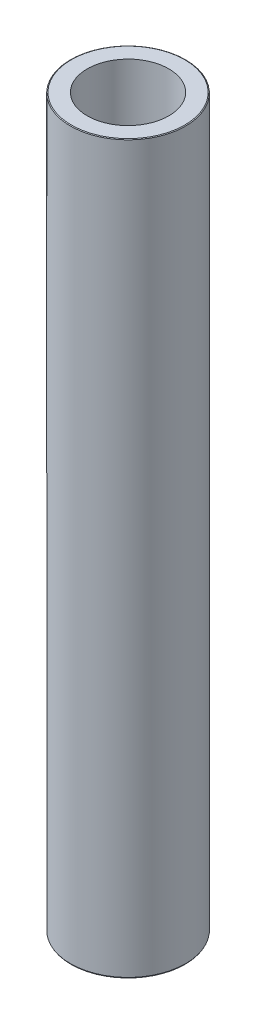
ISO-10303-21;
HEADER;
FILE_DESCRIPTION(('STEP AP214'),'2;1');
FILE_NAME('part.step','',(''),(''),'','','');
FILE_SCHEMA(('AUTOMOTIVE_DESIGN { 1 0 10303 214 1 1 1 1 }'));
ENDSEC;
DATA;
#1=APPLICATION_CONTEXT('core data for automotive mechanical design processes');
#2=APPLICATION_PROTOCOL_DEFINITION('international standard','automotive_design',2000,#1);
#3=PRODUCT_CONTEXT('',#1,'mechanical');
#4=PRODUCT('Part','Part','',(#3));
#5=PRODUCT_RELATED_PRODUCT_CATEGORY('part','',(#4));
#6=PRODUCT_DEFINITION_FORMATION('','',#4);
#7=PRODUCT_DEFINITION_CONTEXT('part definition',#1,'design');
#8=PRODUCT_DEFINITION('design','',#6,#7);
#9=PRODUCT_DEFINITION_SHAPE('','',#8);
#10=(LENGTH_UNIT() NAMED_UNIT(*) SI_UNIT(.MILLI.,.METRE.));
#11=(NAMED_UNIT(*) PLANE_ANGLE_UNIT() SI_UNIT($,.RADIAN.));
#12=(NAMED_UNIT(*) SI_UNIT($,.STERADIAN.) SOLID_ANGLE_UNIT());
#13=UNCERTAINTY_MEASURE_WITH_UNIT(LENGTH_MEASURE(1.E-05),#10,'distance_accuracy_value','');
#14=(GEOMETRIC_REPRESENTATION_CONTEXT(3) GLOBAL_UNCERTAINTY_ASSIGNED_CONTEXT((#13)) GLOBAL_UNIT_ASSIGNED_CONTEXT((#10,
#11,#12)) REPRESENTATION_CONTEXT('',''));
#15=CARTESIAN_POINT('',(0.,0.,0.));
#16=DIRECTION('',(0.,0.,1.));
#17=DIRECTION('',(1.,0.,0.));
#18=AXIS2_PLACEMENT_3D('',#15,#16,#17);
#19=CARTESIAN_POINT('',(0.,600.,0.));
#20=DIRECTION('',(0.,-1.,0.));
#21=DIRECTION('',(0.,0.,-1.));
#22=AXIS2_PLACEMENT_3D('',#19,#20,#21);
#23=CYLINDRICAL_SURFACE('',#22,47.5);
#24=CARTESIAN_POINT('',(0.,599.590765159549,0.));
#25=DIRECTION('',(0.,1.,0.));
#26=DIRECTION('',(0.,0.,1.));
#27=AXIS2_PLACEMENT_3D('',#24,#25,#26);
#28=CIRCLE('',#27,47.5);
#29=CARTESIAN_POINT('',(0.,599.590765159549,-47.5000000000001));
#30=VERTEX_POINT('',#29);
#31=EDGE_CURVE('E50',#30,#30,#28,.F.);
#32=ORIENTED_EDGE('',*,*,#31,.T.);
#33=EDGE_LOOP('',(#32));
#34=FACE_BOUND('',#33,.T.);
#35=CARTESIAN_POINT('',(0.,0.708815535888863,0.));
#36=DIRECTION('',(0.,1.,0.));
#37=DIRECTION('',(0.,0.,1.));
#38=AXIS2_PLACEMENT_3D('',#35,#36,#37);
#39=CIRCLE('',#38,47.5);
#40=CARTESIAN_POINT('',(0.,0.708815535888863,47.5));
#41=VERTEX_POINT('',#40);
#42=EDGE_CURVE('E51',#41,#41,#39,.T.);
#43=ORIENTED_EDGE('',*,*,#42,.T.);
#44=EDGE_LOOP('',(#43));
#45=FACE_BOUND('',#44,.T.);
#46=ADVANCED_FACE('F39',(#34,#45),#23,.T.);
#47=CARTESIAN_POINT('',(0.,600.,0.));
#48=DIRECTION('',(0.,1.,0.));
#49=DIRECTION('',(0.,0.,1.));
#50=AXIS2_PLACEMENT_3D('',#47,#48,#49);
#51=PLANE('',#50);
#52=CARTESIAN_POINT('',(0.,600.,0.));
#53=DIRECTION('',(0.,1.,0.));
#54=DIRECTION('',(0.,0.,1.));
#55=AXIS2_PLACEMENT_3D('',#52,#53,#54);
#56=CIRCLE('',#55,46.7911844641111);
#57=CARTESIAN_POINT('',(0.,600.,-46.7911844641112));
#58=VERTEX_POINT('',#57);
#59=EDGE_CURVE('E54',#58,#58,#56,.T.);
#60=ORIENTED_EDGE('',*,*,#59,.T.);
#61=EDGE_LOOP('',(#60));
#62=FACE_BOUND('',#61,.T.);
#63=CARTESIAN_POINT('',(0.,600.,0.));
#64=DIRECTION('',(0.,1.,0.));
#65=DIRECTION('',(0.,0.,1.));
#66=AXIS2_PLACEMENT_3D('',#63,#64,#65);
#67=CIRCLE('',#66,33.6700277402223);
#68=CARTESIAN_POINT('',(0.,600.,33.6700277402223));
#69=VERTEX_POINT('',#68);
#70=EDGE_CURVE('E58',#69,#69,#67,.T.);
#71=ORIENTED_EDGE('',*,*,#70,.F.);
#72=EDGE_LOOP('',(#71));
#73=FACE_BOUND('',#72,.T.);
#74=ADVANCED_FACE('F69',(#62,#73),#51,.T.);
#75=CARTESIAN_POINT('',(0.,0.,0.));
#76=DIRECTION('',(0.,1.,0.));
#77=DIRECTION('',(0.,0.,1.));
#78=AXIS2_PLACEMENT_3D('',#75,#76,#77);
#79=PLANE('',#78);
#80=CARTESIAN_POINT('',(0.,0.,0.));
#81=DIRECTION('',(0.,1.,0.));
#82=DIRECTION('',(0.,0.,1.));
#83=AXIS2_PLACEMENT_3D('',#80,#81,#82);
#84=CIRCLE('',#83,47.0907651595487);
#85=CARTESIAN_POINT('',(0.,0.,47.0907651595487));
#86=VERTEX_POINT('',#85);
#87=EDGE_CURVE('E10',#86,#86,#84,.F.);
#88=ORIENTED_EDGE('',*,*,#87,.T.);
#89=EDGE_LOOP('',(#88));
#90=FACE_BOUND('',#89,.T.);
#91=CARTESIAN_POINT('',(0.,0.,0.));
#92=DIRECTION('',(0.,1.,0.));
#93=DIRECTION('',(0.,0.,1.));
#94=AXIS2_PLACEMENT_3D('',#91,#92,#93);
#95=CIRCLE('',#94,33.6700277402223);
#96=CARTESIAN_POINT('',(0.,0.,33.6700277402223));
#97=VERTEX_POINT('',#96);
#98=EDGE_CURVE('E63',#97,#97,#95,.T.);
#99=ORIENTED_EDGE('',*,*,#98,.T.);
#100=EDGE_LOOP('',(#99));
#101=FACE_BOUND('',#100,.T.);
#102=ADVANCED_FACE('F75',(#90,#101),#79,.F.);
#103=CARTESIAN_POINT('',(0.,600.,0.));
#104=DIRECTION('',(0.,-1.,0.));
#105=DIRECTION('',(0.,0.,-1.));
#106=AXIS2_PLACEMENT_3D('',#103,#104,#105);
#107=CYLINDRICAL_SURFACE('',#106,33.6700277402223);
#108=ORIENTED_EDGE('',*,*,#70,.T.);
#109=EDGE_LOOP('',(#108));
#110=FACE_BOUND('',#109,.T.);
#111=ORIENTED_EDGE('',*,*,#98,.F.);
#112=EDGE_LOOP('',(#111));
#113=FACE_BOUND('',#112,.T.);
#114=ADVANCED_FACE('F70',(#110,#113),#107,.F.);
#115=CARTESIAN_POINT('',(0.,600.,0.));
#116=DIRECTION('',(0.,-1.,0.));
#117=DIRECTION('',(0.,0.,-1.));
#118=AXIS2_PLACEMENT_3D('',#115,#116,#117);
#119=CONICAL_SURFACE('',#118,46.7911844641111,1.04719755119665);
#120=CARTESIAN_POINT('',(0.,599.590765159549,-47.5000000000001));
#121=CARTESIAN_POINT('',(0.,599.59502802247,-47.4926165048346));
#122=CARTESIAN_POINT('',(0.,599.599290885391,-47.4852330096691));
#123=CARTESIAN_POINT('',(0.,599.607816611234,-47.4704660193381));
#124=CARTESIAN_POINT('',(0.,599.612079474156,-47.4630825241726));
#125=CARTESIAN_POINT('',(0.,599.620605199998,-47.4483155338415));
#126=CARTESIAN_POINT('',(0.,599.62486806292,-47.440932038676));
#127=CARTESIAN_POINT('',(0.,599.633393788762,-47.426165048345));
#128=CARTESIAN_POINT('',(0.,599.637656651684,-47.4187815531795));
#129=CARTESIAN_POINT('',(0.,599.646182377526,-47.4040145628485));
#130=CARTESIAN_POINT('',(0.,599.650445240448,-47.396631067683));
#131=CARTESIAN_POINT('',(0.,599.658970966291,-47.381864077352));
#132=CARTESIAN_POINT('',(0.,599.663233829212,-47.3744805821865));
#133=CARTESIAN_POINT('',(0.,599.671759555055,-47.3597135918554));
#134=CARTESIAN_POINT('',(0.,599.676022417976,-47.3523300966899));
#135=CARTESIAN_POINT('',(0.,599.684548143819,-47.3375631063589));
#136=CARTESIAN_POINT('',(0.,599.68881100674,-47.3301796111934));
#137=CARTESIAN_POINT('',(0.,599.697336732583,-47.3154126208624));
#138=CARTESIAN_POINT('',(0.,599.701599595504,-47.3080291256969));
#139=CARTESIAN_POINT('',(0.,599.710125321347,-47.2932621353658));
#140=CARTESIAN_POINT('',(0.,599.714388184268,-47.2858786402003));
#141=CARTESIAN_POINT('',(0.,599.722913910111,-47.2711116498693));
#142=CARTESIAN_POINT('',(0.,599.727176773032,-47.2637281547038));
#143=CARTESIAN_POINT('',(0.,599.735702498875,-47.2489611643728));
#144=CARTESIAN_POINT('',(0.,599.739965361797,-47.2415776692073));
#145=CARTESIAN_POINT('',(0.,599.748491087639,-47.2268106788763));
#146=CARTESIAN_POINT('',(0.,599.752753950561,-47.2194271837107));
#147=CARTESIAN_POINT('',(0.,599.761279676403,-47.2046601933797));
#148=CARTESIAN_POINT('',(0.,599.765542539325,-47.1972766982142));
#149=CARTESIAN_POINT('',(0.,599.774068265167,-47.1825097078832));
#150=CARTESIAN_POINT('',(0.,599.778331128089,-47.1751262127177));
#151=CARTESIAN_POINT('',(0.,599.786856853932,-47.1603592223867));
#152=CARTESIAN_POINT('',(0.,599.791119716853,-47.1529757272212));
#153=CARTESIAN_POINT('',(0.,599.799645442696,-47.1382087368902));
#154=CARTESIAN_POINT('',(0.,599.803908305617,-47.1308252417247));
#155=CARTESIAN_POINT('',(0.,599.81243403146,-47.1160582513936));
#156=CARTESIAN_POINT('',(0.,599.816696894381,-47.1086747562281));
#157=CARTESIAN_POINT('',(0.,599.825222620224,-47.0939077658971));
#158=CARTESIAN_POINT('',(0.,599.829485483145,-47.0865242707316));
#159=CARTESIAN_POINT('',(0.,599.838011208988,-47.0717572804006));
#160=CARTESIAN_POINT('',(0.,599.842274071909,-47.0643737852351));
#161=CARTESIAN_POINT('',(0.,599.850799797752,-47.049606794904));
#162=CARTESIAN_POINT('',(0.,599.855062660673,-47.0422232997385));
#163=CARTESIAN_POINT('',(0.,599.863588386516,-47.0274563094075));
#164=CARTESIAN_POINT('',(0.,599.867851249438,-47.020072814242));
#165=CARTESIAN_POINT('',(0.,599.87637697528,-47.005305823911));
#166=CARTESIAN_POINT('',(0.,599.880639838202,-46.9979223287455));
#167=CARTESIAN_POINT('',(0.,599.889165564044,-46.9831553384145));
#168=CARTESIAN_POINT('',(0.,599.893428426966,-46.9757718432489));
#169=CARTESIAN_POINT('',(0.,599.901954152808,-46.9610048529179));
#170=CARTESIAN_POINT('',(0.,599.90621701573,-46.9536213577524));
#171=CARTESIAN_POINT('',(0.,599.914742741573,-46.9388543674214));
#172=CARTESIAN_POINT('',(0.,599.919005604494,-46.9314708722559));
#173=CARTESIAN_POINT('',(0.,599.927531330337,-46.9167038819249));
#174=CARTESIAN_POINT('',(0.,599.931794193258,-46.9093203867594));
#175=CARTESIAN_POINT('',(0.,599.940319919101,-46.8945533964284));
#176=CARTESIAN_POINT('',(0.,599.944582782022,-46.8871699012628));
#177=CARTESIAN_POINT('',(0.,599.953108507865,-46.8724029109318));
#178=CARTESIAN_POINT('',(0.,599.957371370786,-46.8650194157663));
#179=CARTESIAN_POINT('',(0.,599.965897096629,-46.8502524254353));
#180=CARTESIAN_POINT('',(0.,599.97015995955,-46.8428689302698));
#181=CARTESIAN_POINT('',(0.,599.978685685393,-46.8281019399388));
#182=CARTESIAN_POINT('',(0.,599.982948548314,-46.8207184447732));
#183=CARTESIAN_POINT('',(0.,599.991474274157,-46.8059514544422));
#184=CARTESIAN_POINT('',(0.,599.995737137079,-46.7985679592767));
#185=CARTESIAN_POINT('',(0.,600.,-46.7911844641112));
#186=B_SPLINE_CURVE_WITH_KNOTS('',3,(#120,#121,#122,#123,#124,#125,#126,#127,#128,#129,#130,
#131,#132,#133,#134,#135,#136,#137,#138,#139,#140,#141,#142,#143,#144,#145,#146,#147,#148,#149,
#150,#151,#152,#153,#154,#155,#156,#157,#158,#159,#160,#161,#162,#163,#164,#165,#166,#167,#168,
#169,#170,#171,#172,#173,#174,#175,#176,#177,#178,#179,#180,#181,#182,#183,#184,#185),
.UNSPECIFIED.,.F.,.F.,(4,2,2,2,2,2,2,2,2,2,2,2,2,2,2,2,2,2,2,2,2,2,2,2,2,2,2,2,2,2,2,2,4),(0.,
0.0255771775281935,0.0511543550563811,0.0767315325845746,0.102308710112768,0.127885887640956,
0.153463065169205,0.179040242697392,0.204617420225586,0.230194597753779,0.255771775281967,
0.281348952810216,0.306926130338403,0.332503307866597,0.358080485394784,0.383657662922978,
0.409234840451227,0.434812017979414,0.460389195507608,0.485966373035795,0.511543550563989,
0.537120728092183,0.562697905620426,0.588275083148619,0.613852260676807,0.639429438205,
0.665006615733194,0.690583793261437,0.71616097078963,0.741738148317818,0.767315325846012,
0.792892503374205,0.818469680902448),.UNSPECIFIED.);
#187=EDGE_CURVE('BSEAM81',#30,#58,#186,.T.);
#188=ORIENTED_EDGE('',*,*,#31,.F.);
#189=ORIENTED_EDGE('',*,*,#59,.F.);
#190=ORIENTED_EDGE('',*,*,#187,.T.);
#191=ORIENTED_EDGE('',*,*,#187,.F.);
#192=EDGE_LOOP('',(#188,#190,#189,#191));
#193=FACE_BOUND('',#192,.T.);
#194=ADVANCED_FACE('F81',(#193),#119,.T.);
#195=CARTESIAN_POINT('',(0.,0.708815535888863,0.));
#196=DIRECTION('',(0.,1.,0.));
#197=DIRECTION('',(0.,0.,1.));
#198=AXIS2_PLACEMENT_3D('',#195,#196,#197);
#199=CONICAL_SURFACE('',#198,47.5,0.523598775598343);
#200=ORIENTED_EDGE('',*,*,#87,.F.);
#201=EDGE_LOOP('',(#200));
#202=FACE_BOUND('',#201,.T.);
#203=ORIENTED_EDGE('',*,*,#42,.F.);
#204=EDGE_LOOP('',(#203));
#205=FACE_BOUND('',#204,.T.);
#206=ADVANCED_FACE('F45',(#202,#205),#199,.T.);
#207=CLOSED_SHELL('',(#46,#74,#102,#114,#194,#206));
#208=MANIFOLD_SOLID_BREP('B2',#207);
#209=ADVANCED_BREP_SHAPE_REPRESENTATION('',(#18,#208),#14);
#210=SHAPE_DEFINITION_REPRESENTATION(#9,#209);
ENDSEC;
END-ISO-10303-21;
